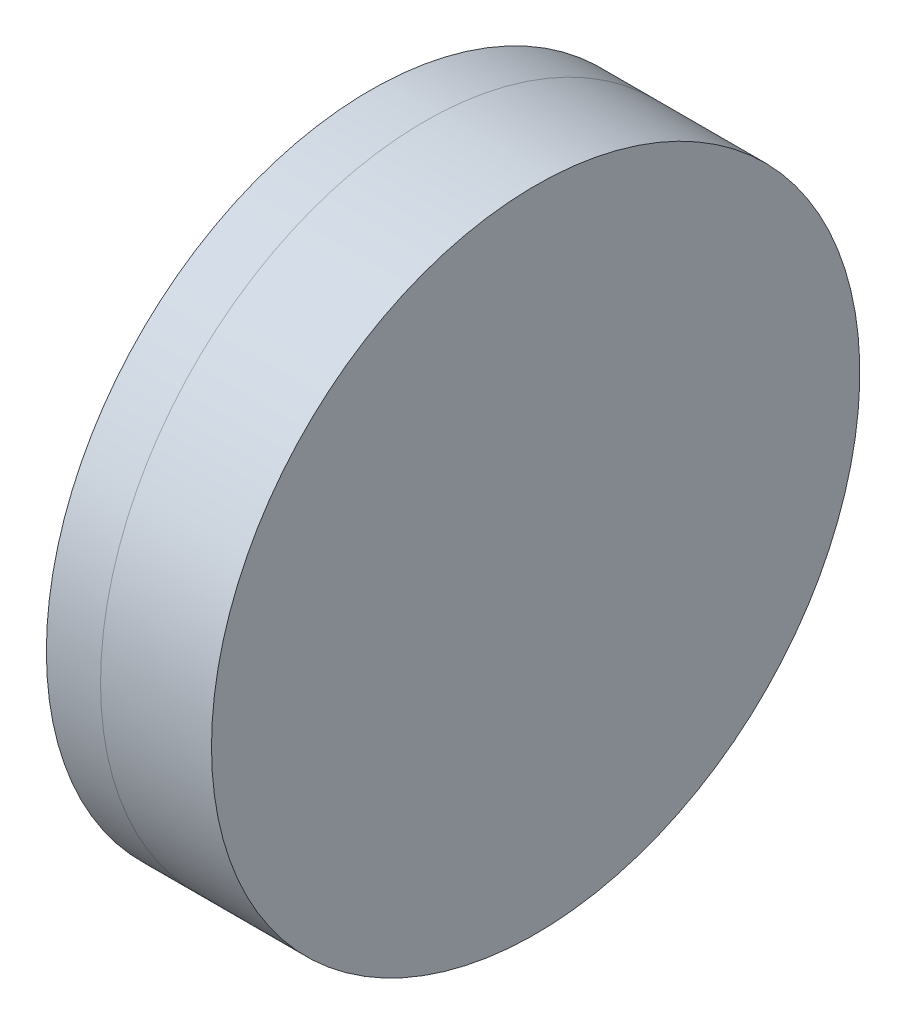
ISO-10303-21;
HEADER;
FILE_DESCRIPTION(('STEP AP214'),'2;1');
FILE_NAME('part.step','',(''),(''),'','','');
FILE_SCHEMA(('AUTOMOTIVE_DESIGN { 1 0 10303 214 1 1 1 1 }'));
ENDSEC;
DATA;
#1=APPLICATION_CONTEXT('core data for automotive mechanical design processes');
#2=APPLICATION_PROTOCOL_DEFINITION('international standard','automotive_design',2000,#1);
#3=PRODUCT_CONTEXT('',#1,'mechanical');
#4=PRODUCT('Part','Part','',(#3));
#5=PRODUCT_RELATED_PRODUCT_CATEGORY('part','',(#4));
#6=PRODUCT_DEFINITION_FORMATION('','',#4);
#7=PRODUCT_DEFINITION_CONTEXT('part definition',#1,'design');
#8=PRODUCT_DEFINITION('design','',#6,#7);
#9=PRODUCT_DEFINITION_SHAPE('','',#8);
#10=(LENGTH_UNIT() NAMED_UNIT(*) SI_UNIT(.MILLI.,.METRE.));
#11=(NAMED_UNIT(*) PLANE_ANGLE_UNIT() SI_UNIT($,.RADIAN.));
#12=(NAMED_UNIT(*) SI_UNIT($,.STERADIAN.) SOLID_ANGLE_UNIT());
#13=UNCERTAINTY_MEASURE_WITH_UNIT(LENGTH_MEASURE(1.E-05),#10,'distance_accuracy_value','');
#14=(GEOMETRIC_REPRESENTATION_CONTEXT(3) GLOBAL_UNCERTAINTY_ASSIGNED_CONTEXT((#13)) GLOBAL_UNIT_ASSIGNED_CONTEXT((#10,
#11,#12)) REPRESENTATION_CONTEXT('',''));
#15=CARTESIAN_POINT('',(0.,0.,0.));
#16=DIRECTION('',(0.,0.,1.));
#17=DIRECTION('',(1.,0.,0.));
#18=AXIS2_PLACEMENT_3D('',#15,#16,#17);
#19=CARTESIAN_POINT('',(250.000125938113,0.,0.));
#20=DIRECTION('',(-1.,0.,0.));
#21=DIRECTION('',(0.,0.,1.));
#22=AXIS2_PLACEMENT_3D('',#19,#20,#21);
#23=SPHERICAL_SURFACE('',#22,89.3300000000001);
#24=CARTESIAN_POINT('',(338.422741257951,0.,0.));
#25=DIRECTION('',(-1.,0.,0.));
#26=DIRECTION('',(0.,0.,1.));
#27=AXIS2_PLACEMENT_3D('',#24,#25,#26);
#28=CIRCLE('',#27,12.7000000000001);
#29=CARTESIAN_POINT('',(338.422741257951,0.,12.7000000000001));
#30=VERTEX_POINT('',#29);
#31=EDGE_CURVE('E11',#30,#30,#28,.T.);
#32=ORIENTED_EDGE('',*,*,#31,.T.);
#33=EDGE_LOOP('',(#32));
#34=FACE_BOUND('',#33,.T.);
#35=ADVANCED_FACE('F45',(#34),#23,.F.);
#36=CARTESIAN_POINT('',(-0.551919992657797,0.,0.));
#37=DIRECTION('',(-1.,0.,0.));
#38=DIRECTION('',(0.,0.,1.));
#39=AXIS2_PLACEMENT_3D('',#36,#37,#38);
#40=CYLINDRICAL_SURFACE('',#39,12.7);
#41=CARTESIAN_POINT('',(342.769512005738,0.,0.));
#42=DIRECTION('',(-1.,0.,0.));
#43=DIRECTION('',(0.,0.,1.));
#44=AXIS2_PLACEMENT_3D('',#41,#42,#43);
#45=CIRCLE('',#44,12.7);
#46=CARTESIAN_POINT('',(342.769512005738,0.,12.7));
#47=VERTEX_POINT('',#46);
#48=EDGE_CURVE('E51',#47,#47,#45,.T.);
#49=ORIENTED_EDGE('',*,*,#48,.T.);
#50=EDGE_LOOP('',(#49));
#51=FACE_BOUND('',#50,.T.);
#52=ORIENTED_EDGE('',*,*,#31,.F.);
#53=EDGE_LOOP('',(#52));
#54=FACE_BOUND('',#53,.T.);
#55=ADVANCED_FACE('F57',(#51,#54),#40,.T.);
#56=CARTESIAN_POINT('',(-987.669874061887,0.,0.));
#57=DIRECTION('',(-1.,0.,0.));
#58=DIRECTION('',(0.,0.,1.));
#59=AXIS2_PLACEMENT_3D('',#56,#57,#58);
#60=SPHERICAL_SURFACE('',#59,1330.5);
#61=ORIENTED_EDGE('',*,*,#48,.F.);
#62=EDGE_LOOP('',(#61));
#63=FACE_BOUND('',#62,.T.);
#64=ADVANCED_FACE('F60',(#63),#60,.T.);
#65=CLOSED_SHELL('',(#35,#55,#64));
#66=MANIFOLD_SOLID_BREP('B2',#65);
#67=CARTESIAN_POINT('',(418.930125938113,0.,0.));
#68=DIRECTION('',(-1.,0.,0.));
#69=DIRECTION('',(0.,0.,-1.));
#70=AXIS2_PLACEMENT_3D('',#67,#68,#69);
#71=SPHERICAL_SURFACE('',#70,83.5999999999999);
#72=CARTESIAN_POINT('',(336.300409733832,0.,0.));
#73=DIRECTION('',(-1.,0.,0.));
#74=DIRECTION('',(0.,0.,1.));
#75=AXIS2_PLACEMENT_3D('',#72,#73,#74);
#76=CIRCLE('',#75,12.7);
#77=CARTESIAN_POINT('',(336.300409733832,0.,12.7));
#78=VERTEX_POINT('',#77);
#79=EDGE_CURVE('E44',#78,#78,#76,.T.);
#80=ORIENTED_EDGE('',*,*,#79,.T.);
#81=EDGE_LOOP('',(#80));
#82=FACE_BOUND('',#81,.T.);
#83=ADVANCED_FACE('F86',(#82),#71,.T.);
#84=CARTESIAN_POINT('',(124.523309526045,0.,0.));
#85=DIRECTION('',(-1.,0.,0.));
#86=DIRECTION('',(0.,0.,1.));
#87=AXIS2_PLACEMENT_3D('',#84,#85,#86);
#88=CYLINDRICAL_SURFACE('',#87,12.7);
#89=CARTESIAN_POINT('',(338.422741257951,0.,0.));
#90=DIRECTION('',(-1.,0.,0.));
#91=DIRECTION('',(0.,0.,1.));
#92=AXIS2_PLACEMENT_3D('',#89,#90,#91);
#93=CIRCLE('',#92,12.7);
#94=CARTESIAN_POINT('',(338.422741257951,0.,12.7));
#95=VERTEX_POINT('',#94);
#96=EDGE_CURVE('E92',#95,#95,#93,.T.);
#97=ORIENTED_EDGE('',*,*,#96,.T.);
#98=EDGE_LOOP('',(#97));
#99=FACE_BOUND('',#98,.T.);
#100=ORIENTED_EDGE('',*,*,#79,.F.);
#101=EDGE_LOOP('',(#100));
#102=FACE_BOUND('',#101,.T.);
#103=ADVANCED_FACE('F98',(#99,#102),#88,.T.);
#104=CARTESIAN_POINT('',(250.000125938113,0.,0.));
#105=DIRECTION('',(-1.,0.,0.));
#106=DIRECTION('',(0.,0.,1.));
#107=AXIS2_PLACEMENT_3D('',#104,#105,#106);
#108=SPHERICAL_SURFACE('',#107,89.3300000000001);
#109=ORIENTED_EDGE('',*,*,#96,.F.);
#110=EDGE_LOOP('',(#109));
#111=FACE_BOUND('',#110,.T.);
#112=ADVANCED_FACE('F101',(#111),#108,.T.);
#113=CLOSED_SHELL('',(#83,#103,#112));
#114=MANIFOLD_SOLID_BREP('B6',#113);
#115=ADVANCED_BREP_SHAPE_REPRESENTATION('',(#18,#66,#114),#14);
#116=SHAPE_DEFINITION_REPRESENTATION(#9,#115);
ENDSEC;
END-ISO-10303-21;
